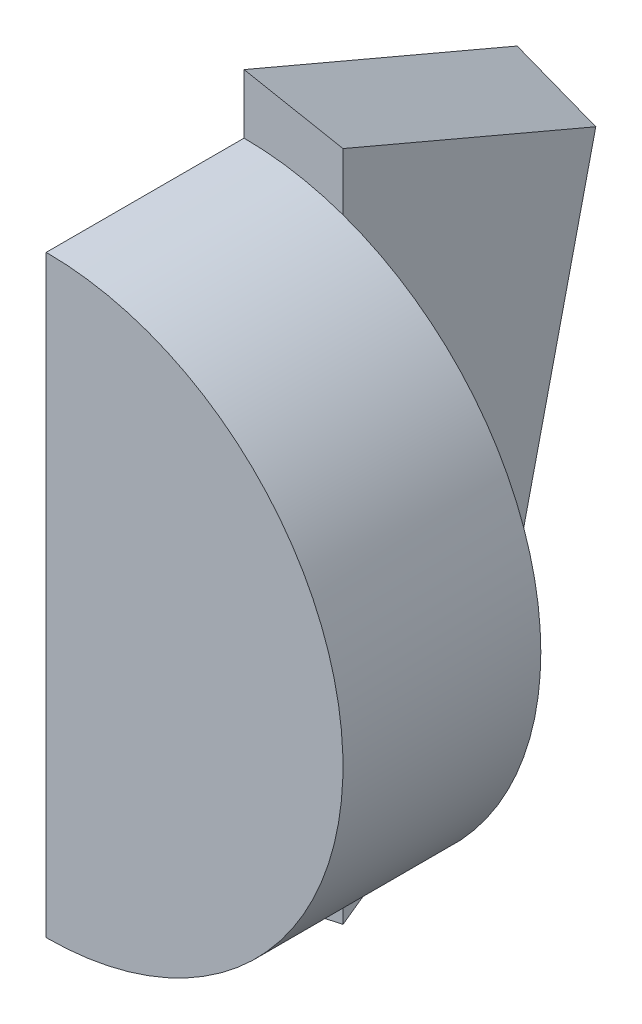
ISO-10303-21;
HEADER;
FILE_DESCRIPTION(('STEP AP214'),'2;1');
FILE_NAME('part.step','',(''),(''),'','','');
FILE_SCHEMA(('AUTOMOTIVE_DESIGN { 1 0 10303 214 1 1 1 1 }'));
ENDSEC;
DATA;
#1=APPLICATION_CONTEXT('core data for automotive mechanical design processes');
#2=APPLICATION_PROTOCOL_DEFINITION('international standard','automotive_design',2000,#1);
#3=PRODUCT_CONTEXT('',#1,'mechanical');
#4=PRODUCT('Part','Part','',(#3));
#5=PRODUCT_RELATED_PRODUCT_CATEGORY('part','',(#4));
#6=PRODUCT_DEFINITION_FORMATION('','',#4);
#7=PRODUCT_DEFINITION_CONTEXT('part definition',#1,'design');
#8=PRODUCT_DEFINITION('design','',#6,#7);
#9=PRODUCT_DEFINITION_SHAPE('','',#8);
#10=(LENGTH_UNIT() NAMED_UNIT(*) SI_UNIT(.MILLI.,.METRE.));
#11=(NAMED_UNIT(*) PLANE_ANGLE_UNIT() SI_UNIT($,.RADIAN.));
#12=(NAMED_UNIT(*) SI_UNIT($,.STERADIAN.) SOLID_ANGLE_UNIT());
#13=UNCERTAINTY_MEASURE_WITH_UNIT(LENGTH_MEASURE(1.E-05),#10,'distance_accuracy_value','');
#14=(GEOMETRIC_REPRESENTATION_CONTEXT(3) GLOBAL_UNCERTAINTY_ASSIGNED_CONTEXT((#13)) GLOBAL_UNIT_ASSIGNED_CONTEXT((#10,
#11,#12)) REPRESENTATION_CONTEXT('',''));
#15=CARTESIAN_POINT('',(0.,0.,0.));
#16=DIRECTION('',(0.,0.,1.));
#17=DIRECTION('',(1.,0.,0.));
#18=AXIS2_PLACEMENT_3D('',#15,#16,#17);
#19=CARTESIAN_POINT('',(0.,0.,0.));
#20=DIRECTION('',(0.,0.,1.));
#21=DIRECTION('',(1.,0.,0.));
#22=AXIS2_PLACEMENT_3D('',#19,#20,#21);
#23=PLANE('',#22);
#24=DIRECTION('',(0.,-1.,0.));
#25=VECTOR('',#24,1.);
#26=CARTESIAN_POINT('',(50.,180.,0.));
#27=LINE('',#26,#25);
#28=CARTESIAN_POINT('',(50.,141.421356237309,0.));
#29=VERTEX_POINT('',#28);
#30=CARTESIAN_POINT('',(50.,-141.421356237309,0.));
#31=VERTEX_POINT('',#30);
#32=EDGE_CURVE('E11',#29,#31,#27,.T.);
#33=ORIENTED_EDGE('',*,*,#32,.F.);
#34=CARTESIAN_POINT('',(0.,0.,0.));
#35=DIRECTION('',(0.,0.,1.));
#36=DIRECTION('',(1.,0.,0.));
#37=AXIS2_PLACEMENT_3D('',#34,#35,#36);
#38=CIRCLE('',#37,150.);
#39=EDGE_CURVE('E136',#31,#29,#38,.T.);
#40=ORIENTED_EDGE('',*,*,#39,.F.);
#41=EDGE_LOOP('',(#33,#40));
#42=FACE_BOUND('',#41,.T.);
#43=ADVANCED_FACE('F37',(#42),#23,.F.);
#44=CARTESIAN_POINT('',(0.,0.,100.));
#45=DIRECTION('',(0.,0.,-1.));
#46=DIRECTION('',(-1.,0.,0.));
#47=AXIS2_PLACEMENT_3D('',#44,#45,#46);
#48=CYLINDRICAL_SURFACE('',#47,150.);
#49=CARTESIAN_POINT('',(0.,-150.,0.));
#50=VERTEX_POINT('',#49);
#51=EDGE_CURVE('E132',#50,#31,#38,.T.);
#52=ORIENTED_EDGE('',*,*,#51,.T.);
#53=ORIENTED_EDGE('',*,*,#39,.T.);
#54=CARTESIAN_POINT('',(0.,150.,0.));
#55=VERTEX_POINT('',#54);
#56=EDGE_CURVE('E97',#29,#55,#38,.T.);
#57=ORIENTED_EDGE('',*,*,#56,.T.);
#58=DIRECTION('',(0.,0.,-1.));
#59=VECTOR('',#58,1.);
#60=CARTESIAN_POINT('',(0.,150.,100.));
#61=LINE('',#60,#59);
#62=CARTESIAN_POINT('',(0.,150.,100.));
#63=VERTEX_POINT('',#62);
#64=EDGE_CURVE('E47',#63,#55,#61,.T.);
#65=ORIENTED_EDGE('',*,*,#64,.F.);
#66=CARTESIAN_POINT('',(0.,0.,100.));
#67=DIRECTION('',(0.,0.,1.));
#68=DIRECTION('',(1.,0.,0.));
#69=AXIS2_PLACEMENT_3D('',#66,#67,#68);
#70=CIRCLE('',#69,150.);
#71=CARTESIAN_POINT('',(0.,-150.,100.));
#72=VERTEX_POINT('',#71);
#73=EDGE_CURVE('E135',#72,#63,#70,.T.);
#74=ORIENTED_EDGE('',*,*,#73,.F.);
#75=DIRECTION('',(0.,0.,-1.));
#76=VECTOR('',#75,1.);
#77=CARTESIAN_POINT('',(0.,-150.,100.));
#78=LINE('',#77,#76);
#79=EDGE_CURVE('E128',#72,#50,#78,.T.);
#80=ORIENTED_EDGE('',*,*,#79,.T.);
#81=EDGE_LOOP('',(#52,#53,#57,#65,#74,#80));
#82=FACE_BOUND('',#81,.T.);
#83=ADVANCED_FACE('F162',(#82),#48,.T.);
#84=CARTESIAN_POINT('',(0.,150.,100.));
#85=DIRECTION('',(1.,0.,0.));
#86=DIRECTION('',(0.,0.,-1.));
#87=AXIS2_PLACEMENT_3D('',#84,#85,#86);
#88=PLANE('',#87);
#89=ORIENTED_EDGE('',*,*,#64,.T.);
#90=DIRECTION('',(0.,-1.,0.));
#91=VECTOR('',#90,1.);
#92=CARTESIAN_POINT('',(0.,180.,0.));
#93=LINE('',#92,#91);
#94=CARTESIAN_POINT('',(0.,180.,0.));
#95=VERTEX_POINT('',#94);
#96=EDGE_CURVE('E111',#95,#55,#93,.T.);
#97=ORIENTED_EDGE('',*,*,#96,.F.);
#98=DIRECTION('',(0.,-0.391326017372919,-0.92025211117772));
#99=VECTOR('',#98,1.);
#100=CARTESIAN_POINT('',(0.,152.435510662869,-64.8213468563156));
#101=LINE('',#100,#99);
#102=CARTESIAN_POINT('',(0.,121.301097394062,-138.037816676658));
#103=VERTEX_POINT('',#102);
#104=EDGE_CURVE('E91',#95,#103,#101,.T.);
#105=ORIENTED_EDGE('',*,*,#104,.T.);
#106=DIRECTION('',(0.,-0.974224463604135,0.225580793764088));
#107=VECTOR('',#106,1.);
#108=CARTESIAN_POINT('',(0.,-24.1634521816858,-104.355631734968));
#109=LINE('',#108,#107);
#110=CARTESIAN_POINT('',(0.,-122.255018506972,-81.6426182356359));
#111=VERTEX_POINT('',#110);
#112=EDGE_CURVE('E41',#103,#111,#109,.T.);
#113=ORIENTED_EDGE('',*,*,#112,.T.);
#114=DIRECTION('',(0.,-0.577449814930284,0.81642618235636));
#115=VECTOR('',#114,1.);
#116=CARTESIAN_POINT('',(0.,-119.979308022656,-84.8601266230653));
#117=LINE('',#116,#115);
#118=CARTESIAN_POINT('',(0.,-180.,0.));
#119=VERTEX_POINT('',#118);
#120=EDGE_CURVE('E106',#111,#119,#117,.T.);
#121=ORIENTED_EDGE('',*,*,#120,.T.);
#122=EDGE_CURVE('E115',#50,#119,#93,.T.);
#123=ORIENTED_EDGE('',*,*,#122,.F.);
#124=ORIENTED_EDGE('',*,*,#79,.F.);
#125=DIRECTION('',(0.,-1.,0.));
#126=VECTOR('',#125,1.);
#127=CARTESIAN_POINT('',(0.,150.,100.));
#128=LINE('',#127,#126);
#129=EDGE_CURVE('E131',#63,#72,#128,.T.);
#130=ORIENTED_EDGE('',*,*,#129,.F.);
#131=EDGE_LOOP('',(#89,#97,#105,#113,#121,#123,#124,#130));
#132=FACE_BOUND('',#131,.T.);
#133=ADVANCED_FACE('F109',(#132),#88,.F.);
#134=CARTESIAN_POINT('',(0.,0.,100.));
#135=DIRECTION('',(0.,0.,1.));
#136=DIRECTION('',(1.,0.,0.));
#137=AXIS2_PLACEMENT_3D('',#134,#135,#136);
#138=PLANE('',#137);
#139=ORIENTED_EDGE('',*,*,#73,.T.);
#140=ORIENTED_EDGE('',*,*,#129,.T.);
#141=EDGE_LOOP('',(#139,#140));
#142=FACE_BOUND('',#141,.T.);
#143=ADVANCED_FACE('F171',(#142),#138,.T.);
#144=CARTESIAN_POINT('',(50.,180.,0.));
#145=DIRECTION('',(0.,0.,-1.));
#146=DIRECTION('',(0.,1.,0.));
#147=AXIS2_PLACEMENT_3D('',#144,#145,#146);
#148=PLANE('',#147);
#149=ORIENTED_EDGE('',*,*,#51,.F.);
#150=ORIENTED_EDGE('',*,*,#122,.T.);
#151=DIRECTION('',(-0.977463006147983,-0.211106777750378,0.));
#152=VECTOR('',#151,1.);
#153=CARTESIAN_POINT('',(122.057360034708,-153.638760939722,0.));
#154=LINE('',#153,#152);
#155=CARTESIAN_POINT('',(50.,-169.201290666625,0.));
#156=VERTEX_POINT('',#155);
#157=EDGE_CURVE('E119',#156,#119,#154,.T.);
#158=ORIENTED_EDGE('',*,*,#157,.F.);
#159=EDGE_CURVE('E50',#31,#156,#27,.T.);
#160=ORIENTED_EDGE('',*,*,#159,.F.);
#161=EDGE_LOOP('',(#149,#150,#158,#160));
#162=FACE_BOUND('',#161,.T.);
#163=ADVANCED_FACE('F148',(#162),#148,.F.);
#164=CARTESIAN_POINT('',(0.,-24.1634521816858,-104.355631734968));
#165=DIRECTION('',(0.173648177666931,-0.222153714629522,-0.959423804931512));
#166=DIRECTION('',(0.,0.974224463604135,-0.225580793764088));
#167=AXIS2_PLACEMENT_3D('',#164,#165,#166);
#168=PLANE('',#167);
#169=ORIENTED_EDGE('',*,*,#112,.F.);
#170=DIRECTION('',(-0.974517168416116,0.101706733035798,-0.199930060064566));
#171=VECTOR('',#170,1.);
#172=CARTESIAN_POINT('',(11.1792650588011,120.134359071001,-135.744300249116));
#173=LINE('',#172,#171);
#174=CARTESIAN_POINT('',(50.,116.082783323664,-127.779913247952));
#175=VERTEX_POINT('',#174);
#176=EDGE_CURVE('E87',#175,#103,#173,.T.);
#177=ORIENTED_EDGE('',*,*,#176,.F.);
#178=DIRECTION('',(0.,-0.974224463604135,0.225580793764088));
#179=VECTOR('',#178,1.);
#180=CARTESIAN_POINT('',(50.,-22.1746531681738,-95.7665288249863));
#181=LINE('',#180,#179);
#182=CARTESIAN_POINT('',(50.,-116.995667215374,-73.8108087487815));
#183=VERTEX_POINT('',#182);
#184=EDGE_CURVE('E112',#175,#183,#181,.T.);
#185=ORIENTED_EDGE('',*,*,#184,.T.);
#186=DIRECTION('',(-0.982661962733809,-0.103363289258156,-0.153920425642193));
#187=VECTOR('',#186,1.);
#188=CARTESIAN_POINT('',(6.52789243907611,-121.568368916354,-80.6201140369655));
#189=LINE('',#188,#187);
#190=EDGE_CURVE('E102',#183,#111,#189,.T.);
#191=ORIENTED_EDGE('',*,*,#190,.T.);
#192=EDGE_LOOP('',(#169,#177,#185,#191));
#193=FACE_BOUND('',#192,.T.);
#194=ADVANCED_FACE('F39',(#193),#168,.T.);
#195=CARTESIAN_POINT('',(0.,152.435510662869,-64.8213468563156));
#196=DIRECTION('',(0.173648177666931,0.90627141381367,-0.385380895864241));
#197=DIRECTION('',(0.,0.391326017372919,0.92025211117772));
#198=AXIS2_PLACEMENT_3D('',#195,#196,#197);
#199=PLANE('',#198);
#200=ORIENTED_EDGE('',*,*,#104,.F.);
#201=DIRECTION('',(-0.982133797856878,0.188183960812884,0.));
#202=VECTOR('',#201,1.);
#203=CARTESIAN_POINT('',(5.09451931072834,179.023853140557,0.));
#204=LINE('',#203,#202);
#205=CARTESIAN_POINT('',(50.,170.419637262076,0.));
#206=VERTEX_POINT('',#205);
#207=EDGE_CURVE('E98',#206,#95,#204,.T.);
#208=ORIENTED_EDGE('',*,*,#207,.F.);
#209=DIRECTION('',(0.,-0.391326017372919,-0.920252111177719));
#210=VECTOR('',#209,1.);
#211=CARTESIAN_POINT('',(50.,144.322246850141,-61.3712801005139));
#212=LINE('',#211,#210);
#213=EDGE_CURVE('E93',#206,#175,#212,.T.);
#214=ORIENTED_EDGE('',*,*,#213,.T.);
#215=ORIENTED_EDGE('',*,*,#176,.T.);
#216=EDGE_LOOP('',(#200,#208,#214,#215));
#217=FACE_BOUND('',#216,.T.);
#218=ADVANCED_FACE('F89',(#217),#199,.T.);
#219=ORIENTED_EDGE('',*,*,#56,.F.);
#220=EDGE_CURVE('E49',#206,#29,#27,.T.);
#221=ORIENTED_EDGE('',*,*,#220,.F.);
#222=ORIENTED_EDGE('',*,*,#207,.T.);
#223=ORIENTED_EDGE('',*,*,#96,.T.);
#224=EDGE_LOOP('',(#219,#221,#222,#223));
#225=FACE_BOUND('',#224,.T.);
#226=ADVANCED_FACE('F176',(#225),#148,.F.);
#227=CARTESIAN_POINT('',(0.,-119.979308022656,-84.8601266230653));
#228=DIRECTION('',(0.173648177666931,-0.804022834146702,-0.568677054718809));
#229=DIRECTION('',(0.,0.577449814930284,-0.81642618235636));
#230=AXIS2_PLACEMENT_3D('',#227,#228,#229);
#231=PLANE('',#230);
#232=ORIENTED_EDGE('',*,*,#120,.F.);
#233=ORIENTED_EDGE('',*,*,#190,.F.);
#234=DIRECTION('',(0.,-0.577449814930284,0.81642618235636));
#235=VECTOR('',#234,1.);
#236=CARTESIAN_POINT('',(50.,-112.781409837345,-79.7691275041994));
#237=LINE('',#236,#235);
#238=EDGE_CURVE('E113',#183,#156,#237,.T.);
#239=ORIENTED_EDGE('',*,*,#238,.T.);
#240=ORIENTED_EDGE('',*,*,#157,.T.);
#241=EDGE_LOOP('',(#232,#233,#239,#240));
#242=FACE_BOUND('',#241,.T.);
#243=ADVANCED_FACE('F151',(#242),#231,.T.);
#244=CARTESIAN_POINT('',(50.,0.,0.));
#245=DIRECTION('',(1.,0.,0.));
#246=DIRECTION('',(0.,0.,-1.));
#247=AXIS2_PLACEMENT_3D('',#244,#245,#246);
#248=PLANE('',#247);
#249=ORIENTED_EDGE('',*,*,#184,.F.);
#250=ORIENTED_EDGE('',*,*,#213,.F.);
#251=ORIENTED_EDGE('',*,*,#220,.T.);
#252=ORIENTED_EDGE('',*,*,#32,.T.);
#253=ORIENTED_EDGE('',*,*,#159,.T.);
#254=ORIENTED_EDGE('',*,*,#238,.F.);
#255=EDGE_LOOP('',(#249,#250,#251,#252,#253,#254));
#256=FACE_BOUND('',#255,.T.);
#257=ADVANCED_FACE('F145',(#256),#248,.T.);
#258=CLOSED_SHELL('',(#43,#83,#133,#143,#163,#194,#218,#226,#243,#257));
#259=MANIFOLD_SOLID_BREP('B2',#258);
#260=ADVANCED_BREP_SHAPE_REPRESENTATION('',(#18,#259),#14);
#261=SHAPE_DEFINITION_REPRESENTATION(#9,#260);
ENDSEC;
END-ISO-10303-21;
